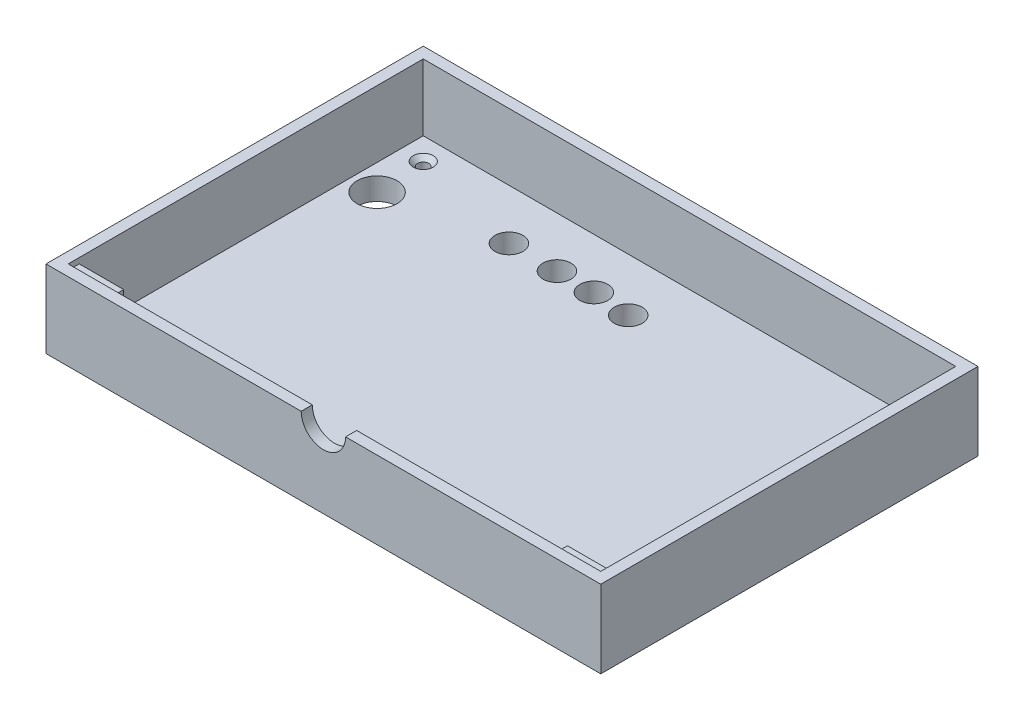
ISO-10303-21;
HEADER;
FILE_DESCRIPTION(('STEP AP214'),'2;1');
FILE_NAME('part.step','',(''),(''),'','','');
FILE_SCHEMA(('AUTOMOTIVE_DESIGN { 1 0 10303 214 1 1 1 1 }'));
ENDSEC;
DATA;
#1=APPLICATION_CONTEXT('core data for automotive mechanical design processes');
#2=APPLICATION_PROTOCOL_DEFINITION('international standard','automotive_design',2000,#1);
#3=PRODUCT_CONTEXT('',#1,'mechanical');
#4=PRODUCT('Part','Part','',(#3));
#5=PRODUCT_RELATED_PRODUCT_CATEGORY('part','',(#4));
#6=PRODUCT_DEFINITION_FORMATION('','',#4);
#7=PRODUCT_DEFINITION_CONTEXT('part definition',#1,'design');
#8=PRODUCT_DEFINITION('design','',#6,#7);
#9=PRODUCT_DEFINITION_SHAPE('','',#8);
#10=(LENGTH_UNIT() NAMED_UNIT(*) SI_UNIT(.MILLI.,.METRE.));
#11=(NAMED_UNIT(*) PLANE_ANGLE_UNIT() SI_UNIT($,.RADIAN.));
#12=(NAMED_UNIT(*) SI_UNIT($,.STERADIAN.) SOLID_ANGLE_UNIT());
#13=UNCERTAINTY_MEASURE_WITH_UNIT(LENGTH_MEASURE(1.E-05),#10,'distance_accuracy_value','');
#14=(GEOMETRIC_REPRESENTATION_CONTEXT(3) GLOBAL_UNCERTAINTY_ASSIGNED_CONTEXT((#13)) GLOBAL_UNIT_ASSIGNED_CONTEXT((#10,
#11,#12)) REPRESENTATION_CONTEXT('',''));
#15=CARTESIAN_POINT('',(0.,0.,0.));
#16=DIRECTION('',(0.,0.,1.));
#17=DIRECTION('',(1.,0.,0.));
#18=AXIS2_PLACEMENT_3D('',#15,#16,#17);
#19=CARTESIAN_POINT('',(-152.4,47.625,95.25));
#20=DIRECTION('',(1.,0.,0.));
#21=DIRECTION('',(0.,0.,-1.));
#22=AXIS2_PLACEMENT_3D('',#19,#20,#21);
#23=PLANE('',#22);
#24=DIRECTION('',(0.,1.,0.));
#25=VECTOR('',#24,1.);
#26=CARTESIAN_POINT('',(-152.4,47.625,101.6));
#27=LINE('',#26,#25);
#28=CARTESIAN_POINT('',(-152.4,41.275,101.6));
#29=VERTEX_POINT('',#28);
#30=CARTESIAN_POINT('',(-152.4,47.625,101.6));
#31=VERTEX_POINT('',#30);
#32=EDGE_CURVE('E109',#29,#31,#27,.T.);
#33=ORIENTED_EDGE('',*,*,#32,.T.);
#34=DIRECTION('',(0.,0.,1.));
#35=VECTOR('',#34,1.);
#36=CARTESIAN_POINT('',(-152.4,47.625,95.25));
#37=LINE('',#36,#35);
#38=CARTESIAN_POINT('',(-152.4,47.625,95.25));
#39=VERTEX_POINT('',#38);
#40=EDGE_CURVE('E12',#39,#31,#37,.T.);
#41=ORIENTED_EDGE('',*,*,#40,.F.);
#42=DIRECTION('',(0.,1.,0.));
#43=VECTOR('',#42,1.);
#44=CARTESIAN_POINT('',(-152.4,47.625,95.25));
#45=LINE('',#44,#43);
#46=CARTESIAN_POINT('',(-152.4,41.275,95.25));
#47=VERTEX_POINT('',#46);
#48=EDGE_CURVE('E97',#47,#39,#45,.T.);
#49=ORIENTED_EDGE('',*,*,#48,.F.);
#50=DIRECTION('',(0.,0.,1.));
#51=VECTOR('',#50,1.);
#52=CARTESIAN_POINT('',(-152.4,41.275,95.25));
#53=LINE('',#52,#51);
#54=EDGE_CURVE('E105',#47,#29,#53,.T.);
#55=ORIENTED_EDGE('',*,*,#54,.T.);
#56=EDGE_LOOP('',(#33,#41,#49,#55));
#57=FACE_BOUND('',#56,.T.);
#58=ADVANCED_FACE('F46',(#57),#23,.F.);
#59=CARTESIAN_POINT('',(-152.4,47.625,95.25));
#60=DIRECTION('',(0.,-1.,0.));
#61=DIRECTION('',(0.,0.,-1.));
#62=AXIS2_PLACEMENT_3D('',#59,#60,#61);
#63=PLANE('',#62);
#64=DIRECTION('',(1.,0.,0.));
#65=VECTOR('',#64,1.);
#66=CARTESIAN_POINT('',(-152.4,47.625,101.6));
#67=LINE('',#66,#65);
#68=CARTESIAN_POINT('',(-127.,47.625,101.6));
#69=VERTEX_POINT('',#68);
#70=EDGE_CURVE('E101',#31,#69,#67,.T.);
#71=ORIENTED_EDGE('',*,*,#70,.T.);
#72=DIRECTION('',(0.,0.,1.));
#73=VECTOR('',#72,1.);
#74=CARTESIAN_POINT('',(-127.,47.625,95.25));
#75=LINE('',#74,#73);
#76=CARTESIAN_POINT('',(-127.,47.625,95.25));
#77=VERTEX_POINT('',#76);
#78=EDGE_CURVE('E54',#77,#69,#75,.T.);
#79=ORIENTED_EDGE('',*,*,#78,.F.);
#80=DIRECTION('',(1.,0.,0.));
#81=VECTOR('',#80,1.);
#82=CARTESIAN_POINT('',(-152.4,47.625,95.25));
#83=LINE('',#82,#81);
#84=EDGE_CURVE('E92',#39,#77,#83,.T.);
#85=ORIENTED_EDGE('',*,*,#84,.F.);
#86=ORIENTED_EDGE('',*,*,#40,.T.);
#87=EDGE_LOOP('',(#71,#79,#85,#86));
#88=FACE_BOUND('',#87,.T.);
#89=ADVANCED_FACE('F100',(#88),#63,.F.);
#90=CARTESIAN_POINT('',(-127.,47.625,95.25));
#91=DIRECTION('',(-1.,0.,0.));
#92=DIRECTION('',(0.,0.,1.));
#93=AXIS2_PLACEMENT_3D('',#90,#91,#92);
#94=PLANE('',#93);
#95=DIRECTION('',(0.,-1.,0.));
#96=VECTOR('',#95,1.);
#97=CARTESIAN_POINT('',(-127.,47.625,101.6));
#98=LINE('',#97,#96);
#99=CARTESIAN_POINT('',(-127.,41.275,101.6));
#100=VERTEX_POINT('',#99);
#101=EDGE_CURVE('E79',#69,#100,#98,.T.);
#102=ORIENTED_EDGE('',*,*,#101,.T.);
#103=DIRECTION('',(0.,0.,1.));
#104=VECTOR('',#103,1.);
#105=CARTESIAN_POINT('',(-127.,41.275,95.25));
#106=LINE('',#105,#104);
#107=CARTESIAN_POINT('',(-127.,41.275,95.25));
#108=VERTEX_POINT('',#107);
#109=EDGE_CURVE('E102',#108,#100,#106,.T.);
#110=ORIENTED_EDGE('',*,*,#109,.F.);
#111=DIRECTION('',(0.,-1.,0.));
#112=VECTOR('',#111,1.);
#113=CARTESIAN_POINT('',(-127.,47.625,95.25));
#114=LINE('',#113,#112);
#115=EDGE_CURVE('E95',#77,#108,#114,.T.);
#116=ORIENTED_EDGE('',*,*,#115,.F.);
#117=ORIENTED_EDGE('',*,*,#78,.T.);
#118=EDGE_LOOP('',(#102,#110,#116,#117));
#119=FACE_BOUND('',#118,.T.);
#120=ADVANCED_FACE('F103',(#119),#94,.F.);
#121=CARTESIAN_POINT('',(-152.4,41.275,95.25));
#122=DIRECTION('',(0.,1.,0.));
#123=DIRECTION('',(0.,0.,1.));
#124=AXIS2_PLACEMENT_3D('',#121,#122,#123);
#125=PLANE('',#124);
#126=DIRECTION('',(-1.,0.,0.));
#127=VECTOR('',#126,1.);
#128=CARTESIAN_POINT('',(-152.4,41.275,101.6));
#129=LINE('',#128,#127);
#130=EDGE_CURVE('E85',#100,#29,#129,.T.);
#131=ORIENTED_EDGE('',*,*,#130,.T.);
#132=ORIENTED_EDGE('',*,*,#54,.F.);
#133=DIRECTION('',(-1.,0.,0.));
#134=VECTOR('',#133,1.);
#135=CARTESIAN_POINT('',(-152.4,41.275,95.25));
#136=LINE('',#135,#134);
#137=EDGE_CURVE('E62',#108,#47,#136,.T.);
#138=ORIENTED_EDGE('',*,*,#137,.F.);
#139=ORIENTED_EDGE('',*,*,#109,.T.);
#140=EDGE_LOOP('',(#131,#132,#138,#139));
#141=FACE_BOUND('',#140,.T.);
#142=ADVANCED_FACE('F116',(#141),#125,.F.);
#143=CARTESIAN_POINT('',(0.,0.,95.25));
#144=DIRECTION('',(0.,0.,1.));
#145=DIRECTION('',(1.,0.,0.));
#146=AXIS2_PLACEMENT_3D('',#143,#144,#145);
#147=PLANE('',#146);
#148=ORIENTED_EDGE('',*,*,#48,.T.);
#149=ORIENTED_EDGE('',*,*,#84,.T.);
#150=ORIENTED_EDGE('',*,*,#115,.T.);
#151=ORIENTED_EDGE('',*,*,#137,.T.);
#152=EDGE_LOOP('',(#148,#149,#150,#151));
#153=FACE_BOUND('',#152,.T.);
#154=ADVANCED_FACE('F93',(#153),#147,.F.);
#155=CARTESIAN_POINT('',(0.,0.,101.6));
#156=DIRECTION('',(0.,0.,1.));
#157=DIRECTION('',(1.,0.,0.));
#158=AXIS2_PLACEMENT_3D('',#155,#156,#157);
#159=PLANE('',#158);
#160=ORIENTED_EDGE('',*,*,#32,.F.);
#161=ORIENTED_EDGE('',*,*,#130,.F.);
#162=ORIENTED_EDGE('',*,*,#101,.F.);
#163=ORIENTED_EDGE('',*,*,#70,.F.);
#164=EDGE_LOOP('',(#160,#161,#162,#163));
#165=FACE_BOUND('',#164,.T.);
#166=ADVANCED_FACE('F119',(#165),#159,.T.);
#167=CLOSED_SHELL('',(#58,#89,#120,#142,#154,#166));
#168=MANIFOLD_SOLID_BREP('B2',#167);
#169=CARTESIAN_POINT('',(152.4,47.625,95.25));
#170=DIRECTION('',(-1.,0.,0.));
#171=DIRECTION('',(0.,0.,1.));
#172=AXIS2_PLACEMENT_3D('',#169,#170,#171);
#173=PLANE('',#172);
#174=DIRECTION('',(0.,-1.,0.));
#175=VECTOR('',#174,1.);
#176=CARTESIAN_POINT('',(152.4,47.625,101.6));
#177=LINE('',#176,#175);
#178=CARTESIAN_POINT('',(152.4,47.625,101.6));
#179=VERTEX_POINT('',#178);
#180=CARTESIAN_POINT('',(152.4,41.275,101.6));
#181=VERTEX_POINT('',#180);
#182=EDGE_CURVE('E242',#179,#181,#177,.T.);
#183=ORIENTED_EDGE('',*,*,#182,.T.);
#184=DIRECTION('',(0.,0.,1.));
#185=VECTOR('',#184,1.);
#186=CARTESIAN_POINT('',(152.4,41.275,95.25));
#187=LINE('',#186,#185);
#188=CARTESIAN_POINT('',(152.4,41.275,95.25));
#189=VERTEX_POINT('',#188);
#190=EDGE_CURVE('E44',#189,#181,#187,.T.);
#191=ORIENTED_EDGE('',*,*,#190,.F.);
#192=DIRECTION('',(0.,-1.,0.));
#193=VECTOR('',#192,1.);
#194=CARTESIAN_POINT('',(152.4,47.625,95.25));
#195=LINE('',#194,#193);
#196=CARTESIAN_POINT('',(152.4,47.625,95.25));
#197=VERTEX_POINT('',#196);
#198=EDGE_CURVE('E230',#197,#189,#195,.T.);
#199=ORIENTED_EDGE('',*,*,#198,.F.);
#200=DIRECTION('',(0.,0.,1.));
#201=VECTOR('',#200,1.);
#202=CARTESIAN_POINT('',(152.4,47.625,95.25));
#203=LINE('',#202,#201);
#204=EDGE_CURVE('E238',#197,#179,#203,.T.);
#205=ORIENTED_EDGE('',*,*,#204,.T.);
#206=EDGE_LOOP('',(#183,#191,#199,#205));
#207=FACE_BOUND('',#206,.T.);
#208=ADVANCED_FACE('F179',(#207),#173,.F.);
#209=CARTESIAN_POINT('',(152.4,41.275,95.25));
#210=DIRECTION('',(0.,1.,0.));
#211=DIRECTION('',(0.,0.,1.));
#212=AXIS2_PLACEMENT_3D('',#209,#210,#211);
#213=PLANE('',#212);
#214=DIRECTION('',(-1.,0.,0.));
#215=VECTOR('',#214,1.);
#216=CARTESIAN_POINT('',(152.4,41.275,101.6));
#217=LINE('',#216,#215);
#218=CARTESIAN_POINT('',(127.,41.275,101.6));
#219=VERTEX_POINT('',#218);
#220=EDGE_CURVE('E234',#181,#219,#217,.T.);
#221=ORIENTED_EDGE('',*,*,#220,.T.);
#222=DIRECTION('',(0.,0.,1.));
#223=VECTOR('',#222,1.);
#224=CARTESIAN_POINT('',(127.,41.275,95.25));
#225=LINE('',#224,#223);
#226=CARTESIAN_POINT('',(127.,41.275,95.25));
#227=VERTEX_POINT('',#226);
#228=EDGE_CURVE('E187',#227,#219,#225,.T.);
#229=ORIENTED_EDGE('',*,*,#228,.F.);
#230=DIRECTION('',(-1.,0.,0.));
#231=VECTOR('',#230,1.);
#232=CARTESIAN_POINT('',(152.4,41.275,95.25));
#233=LINE('',#232,#231);
#234=EDGE_CURVE('E225',#189,#227,#233,.T.);
#235=ORIENTED_EDGE('',*,*,#234,.F.);
#236=ORIENTED_EDGE('',*,*,#190,.T.);
#237=EDGE_LOOP('',(#221,#229,#235,#236));
#238=FACE_BOUND('',#237,.T.);
#239=ADVANCED_FACE('F233',(#238),#213,.F.);
#240=CARTESIAN_POINT('',(127.,47.625,95.25));
#241=DIRECTION('',(1.,0.,0.));
#242=DIRECTION('',(0.,0.,-1.));
#243=AXIS2_PLACEMENT_3D('',#240,#241,#242);
#244=PLANE('',#243);
#245=DIRECTION('',(0.,1.,0.));
#246=VECTOR('',#245,1.);
#247=CARTESIAN_POINT('',(127.,47.625,101.6));
#248=LINE('',#247,#246);
#249=CARTESIAN_POINT('',(127.,47.625,101.6));
#250=VERTEX_POINT('',#249);
#251=EDGE_CURVE('E212',#219,#250,#248,.T.);
#252=ORIENTED_EDGE('',*,*,#251,.T.);
#253=DIRECTION('',(0.,0.,1.));
#254=VECTOR('',#253,1.);
#255=CARTESIAN_POINT('',(127.,47.625,95.25));
#256=LINE('',#255,#254);
#257=CARTESIAN_POINT('',(127.,47.625,95.25));
#258=VERTEX_POINT('',#257);
#259=EDGE_CURVE('E235',#258,#250,#256,.T.);
#260=ORIENTED_EDGE('',*,*,#259,.F.);
#261=DIRECTION('',(0.,1.,0.));
#262=VECTOR('',#261,1.);
#263=CARTESIAN_POINT('',(127.,47.625,95.25));
#264=LINE('',#263,#262);
#265=EDGE_CURVE('E228',#227,#258,#264,.T.);
#266=ORIENTED_EDGE('',*,*,#265,.F.);
#267=ORIENTED_EDGE('',*,*,#228,.T.);
#268=EDGE_LOOP('',(#252,#260,#266,#267));
#269=FACE_BOUND('',#268,.T.);
#270=ADVANCED_FACE('F236',(#269),#244,.F.);
#271=CARTESIAN_POINT('',(152.4,47.625,95.25));
#272=DIRECTION('',(0.,-1.,0.));
#273=DIRECTION('',(0.,0.,-1.));
#274=AXIS2_PLACEMENT_3D('',#271,#272,#273);
#275=PLANE('',#274);
#276=DIRECTION('',(1.,0.,0.));
#277=VECTOR('',#276,1.);
#278=CARTESIAN_POINT('',(152.4,47.625,101.6));
#279=LINE('',#278,#277);
#280=EDGE_CURVE('E218',#250,#179,#279,.T.);
#281=ORIENTED_EDGE('',*,*,#280,.T.);
#282=ORIENTED_EDGE('',*,*,#204,.F.);
#283=DIRECTION('',(1.,0.,0.));
#284=VECTOR('',#283,1.);
#285=CARTESIAN_POINT('',(152.4,47.625,95.25));
#286=LINE('',#285,#284);
#287=EDGE_CURVE('E195',#258,#197,#286,.T.);
#288=ORIENTED_EDGE('',*,*,#287,.F.);
#289=ORIENTED_EDGE('',*,*,#259,.T.);
#290=EDGE_LOOP('',(#281,#282,#288,#289));
#291=FACE_BOUND('',#290,.T.);
#292=ADVANCED_FACE('F249',(#291),#275,.F.);
#293=CARTESIAN_POINT('',(0.,0.,95.25));
#294=DIRECTION('',(0.,0.,-1.));
#295=DIRECTION('',(-1.,0.,0.));
#296=AXIS2_PLACEMENT_3D('',#293,#294,#295);
#297=PLANE('',#296);
#298=ORIENTED_EDGE('',*,*,#198,.T.);
#299=ORIENTED_EDGE('',*,*,#234,.T.);
#300=ORIENTED_EDGE('',*,*,#265,.T.);
#301=ORIENTED_EDGE('',*,*,#287,.T.);
#302=EDGE_LOOP('',(#298,#299,#300,#301));
#303=FACE_BOUND('',#302,.T.);
#304=ADVANCED_FACE('F226',(#303),#297,.T.);
#305=CARTESIAN_POINT('',(0.,0.,101.6));
#306=DIRECTION('',(0.,0.,-1.));
#307=DIRECTION('',(-1.,0.,0.));
#308=AXIS2_PLACEMENT_3D('',#305,#306,#307);
#309=PLANE('',#308);
#310=ORIENTED_EDGE('',*,*,#182,.F.);
#311=ORIENTED_EDGE('',*,*,#280,.F.);
#312=ORIENTED_EDGE('',*,*,#251,.F.);
#313=ORIENTED_EDGE('',*,*,#220,.F.);
#314=EDGE_LOOP('',(#310,#311,#312,#313));
#315=FACE_BOUND('',#314,.T.);
#316=ADVANCED_FACE('F252',(#315),#309,.F.);
#317=CLOSED_SHELL('',(#208,#239,#270,#292,#304,#316));
#318=MANIFOLD_SOLID_BREP('B6',#317);
#319=CARTESIAN_POINT('',(158.75,12.7,107.95));
#320=DIRECTION('',(0.,0.,-1.));
#321=DIRECTION('',(-1.,0.,0.));
#322=AXIS2_PLACEMENT_3D('',#319,#320,#321);
#323=PLANE('',#322);
#324=CARTESIAN_POINT('',(0.,50.8,107.95));
#325=DIRECTION('',(0.,0.,-1.));
#326=DIRECTION('',(-1.,0.,0.));
#327=AXIS2_PLACEMENT_3D('',#324,#325,#326);
#328=CIRCLE('',#327,12.7);
#329=CARTESIAN_POINT('',(12.7,50.8,107.95));
#330=VERTEX_POINT('',#329);
#331=CARTESIAN_POINT('',(-12.7,50.8,107.95));
#332=VERTEX_POINT('',#331);
#333=EDGE_CURVE('E409',#330,#332,#328,.T.);
#334=ORIENTED_EDGE('',*,*,#333,.T.);
#335=DIRECTION('',(1.,0.,0.));
#336=VECTOR('',#335,1.);
#337=CARTESIAN_POINT('',(-158.75,50.8,107.95));
#338=LINE('',#337,#336);
#339=CARTESIAN_POINT('',(-158.75,50.8,107.95));
#340=VERTEX_POINT('',#339);
#341=EDGE_CURVE('E419',#340,#332,#338,.T.);
#342=ORIENTED_EDGE('',*,*,#341,.F.);
#343=DIRECTION('',(0.,-1.,0.));
#344=VECTOR('',#343,1.);
#345=CARTESIAN_POINT('',(-158.75,12.7,107.95));
#346=LINE('',#345,#344);
#347=CARTESIAN_POINT('',(-158.75,6.35,107.95));
#348=VERTEX_POINT('',#347);
#349=EDGE_CURVE('E490',#340,#348,#346,.T.);
#350=ORIENTED_EDGE('',*,*,#349,.T.);
#351=DIRECTION('',(1.,0.,0.));
#352=VECTOR('',#351,1.);
#353=CARTESIAN_POINT('',(158.75,6.35,107.95));
#354=LINE('',#353,#352);
#355=CARTESIAN_POINT('',(158.75,6.35,107.95));
#356=VERTEX_POINT('',#355);
#357=EDGE_CURVE('E475',#348,#356,#354,.T.);
#358=ORIENTED_EDGE('',*,*,#357,.T.);
#359=DIRECTION('',(0.,-1.,0.));
#360=VECTOR('',#359,1.);
#361=CARTESIAN_POINT('',(158.75,12.7,107.95));
#362=LINE('',#361,#360);
#363=CARTESIAN_POINT('',(158.75,50.8,107.95));
#364=VERTEX_POINT('',#363);
#365=EDGE_CURVE('E487',#364,#356,#362,.T.);
#366=ORIENTED_EDGE('',*,*,#365,.F.);
#367=EDGE_CURVE('E452',#330,#364,#338,.T.);
#368=ORIENTED_EDGE('',*,*,#367,.F.);
#369=EDGE_LOOP('',(#334,#342,#350,#358,#366,#368));
#370=FACE_BOUND('',#369,.T.);
#371=ADVANCED_FACE('F303',(#370),#323,.F.);
#372=CARTESIAN_POINT('',(0.,50.8,0.));
#373=DIRECTION('',(0.,1.,0.));
#374=DIRECTION('',(0.,0.,1.));
#375=AXIS2_PLACEMENT_3D('',#372,#373,#374);
#376=PLANE('',#375);
#377=ORIENTED_EDGE('',*,*,#341,.T.);
#378=DIRECTION('',(0.,0.,1.));
#379=VECTOR('',#378,1.);
#380=CARTESIAN_POINT('',(-12.7,50.8,101.6));
#381=LINE('',#380,#379);
#382=CARTESIAN_POINT('',(-12.7,50.8,101.6));
#383=VERTEX_POINT('',#382);
#384=EDGE_CURVE('E404',#383,#332,#381,.T.);
#385=ORIENTED_EDGE('',*,*,#384,.F.);
#386=DIRECTION('',(1.,0.,0.));
#387=VECTOR('',#386,1.);
#388=CARTESIAN_POINT('',(152.4,50.8,101.6));
#389=LINE('',#388,#387);
#390=CARTESIAN_POINT('',(-152.4,50.8,101.6));
#391=VERTEX_POINT('',#390);
#392=EDGE_CURVE('E416',#391,#383,#389,.T.);
#393=ORIENTED_EDGE('',*,*,#392,.F.);
#394=DIRECTION('',(0.,0.,1.));
#395=VECTOR('',#394,1.);
#396=CARTESIAN_POINT('',(-152.4,50.8,101.6));
#397=LINE('',#396,#395);
#398=CARTESIAN_POINT('',(-152.4,50.8,-101.6));
#399=VERTEX_POINT('',#398);
#400=EDGE_CURVE('E431',#399,#391,#397,.T.);
#401=ORIENTED_EDGE('',*,*,#400,.F.);
#402=DIRECTION('',(-1.,0.,0.));
#403=VECTOR('',#402,1.);
#404=CARTESIAN_POINT('',(152.4,50.8,-101.6));
#405=LINE('',#404,#403);
#406=CARTESIAN_POINT('',(152.4,50.8,-101.6));
#407=VERTEX_POINT('',#406);
#408=EDGE_CURVE('E660',#407,#399,#405,.T.);
#409=ORIENTED_EDGE('',*,*,#408,.F.);
#410=DIRECTION('',(0.,0.,-1.));
#411=VECTOR('',#410,1.);
#412=CARTESIAN_POINT('',(152.4,50.8,101.6));
#413=LINE('',#412,#411);
#414=CARTESIAN_POINT('',(152.4,50.8,101.6));
#415=VERTEX_POINT('',#414);
#416=EDGE_CURVE('E441',#415,#407,#413,.T.);
#417=ORIENTED_EDGE('',*,*,#416,.F.);
#418=CARTESIAN_POINT('',(12.7,50.8,101.6));
#419=VERTEX_POINT('',#418);
#420=EDGE_CURVE('E427',#419,#415,#389,.T.);
#421=ORIENTED_EDGE('',*,*,#420,.F.);
#422=DIRECTION('',(0.,0.,1.));
#423=VECTOR('',#422,1.);
#424=CARTESIAN_POINT('',(12.7,50.8,101.6));
#425=LINE('',#424,#423);
#426=EDGE_CURVE('E318',#419,#330,#425,.T.);
#427=ORIENTED_EDGE('',*,*,#426,.T.);
#428=ORIENTED_EDGE('',*,*,#367,.T.);
#429=DIRECTION('',(0.,0.,-1.));
#430=VECTOR('',#429,1.);
#431=CARTESIAN_POINT('',(158.75,50.8,-107.95));
#432=LINE('',#431,#430);
#433=CARTESIAN_POINT('',(158.75,50.8,-107.95));
#434=VERTEX_POINT('',#433);
#435=EDGE_CURVE('E454',#364,#434,#432,.T.);
#436=ORIENTED_EDGE('',*,*,#435,.T.);
#437=DIRECTION('',(-1.,0.,0.));
#438=VECTOR('',#437,1.);
#439=CARTESIAN_POINT('',(-158.75,50.8,-107.95));
#440=LINE('',#439,#438);
#441=CARTESIAN_POINT('',(-158.75,50.8,-107.95));
#442=VERTEX_POINT('',#441);
#443=EDGE_CURVE('E457',#434,#442,#440,.T.);
#444=ORIENTED_EDGE('',*,*,#443,.T.);
#445=DIRECTION('',(0.,0.,1.));
#446=VECTOR('',#445,1.);
#447=CARTESIAN_POINT('',(-158.75,50.8,-107.95));
#448=LINE('',#447,#446);
#449=EDGE_CURVE('E450',#442,#340,#448,.T.);
#450=ORIENTED_EDGE('',*,*,#449,.T.);
#451=EDGE_LOOP('',(#377,#385,#393,#401,#409,#417,#421,#427,#428,#436,#444,#450));
#452=FACE_BOUND('',#451,.T.);
#453=ADVANCED_FACE('F414',(#452),#376,.T.);
#454=CARTESIAN_POINT('',(152.4,50.8,101.6));
#455=DIRECTION('',(0.,0.,-1.));
#456=DIRECTION('',(-1.,0.,0.));
#457=AXIS2_PLACEMENT_3D('',#454,#455,#456);
#458=PLANE('',#457);
#459=ORIENTED_EDGE('',*,*,#392,.T.);
#460=CARTESIAN_POINT('',(0.,50.8,101.6));
#461=DIRECTION('',(0.,0.,-1.));
#462=DIRECTION('',(-1.,0.,0.));
#463=AXIS2_PLACEMENT_3D('',#460,#461,#462);
#464=CIRCLE('',#463,12.7);
#465=EDGE_CURVE('E401',#419,#383,#464,.T.);
#466=ORIENTED_EDGE('',*,*,#465,.F.);
#467=ORIENTED_EDGE('',*,*,#420,.T.);
#468=DIRECTION('',(0.,-1.,0.));
#469=VECTOR('',#468,1.);
#470=CARTESIAN_POINT('',(152.4,50.8,101.6));
#471=LINE('',#470,#469);
#472=CARTESIAN_POINT('',(152.4,12.7,101.6));
#473=VERTEX_POINT('',#472);
#474=EDGE_CURVE('E426',#415,#473,#471,.T.);
#475=ORIENTED_EDGE('',*,*,#474,.T.);
#476=DIRECTION('',(1.,0.,0.));
#477=VECTOR('',#476,1.);
#478=CARTESIAN_POINT('',(152.4,12.7,101.6));
#479=LINE('',#478,#477);
#480=CARTESIAN_POINT('',(-152.4,12.7,101.6));
#481=VERTEX_POINT('',#480);
#482=EDGE_CURVE('E440',#481,#473,#479,.T.);
#483=ORIENTED_EDGE('',*,*,#482,.F.);
#484=DIRECTION('',(0.,-1.,0.));
#485=VECTOR('',#484,1.);
#486=CARTESIAN_POINT('',(-152.4,50.8,101.6));
#487=LINE('',#486,#485);
#488=EDGE_CURVE('E424',#391,#481,#487,.T.);
#489=ORIENTED_EDGE('',*,*,#488,.F.);
#490=EDGE_LOOP('',(#459,#466,#467,#475,#483,#489));
#491=FACE_BOUND('',#490,.T.);
#492=ADVANCED_FACE('F421',(#491),#458,.T.);
#493=CARTESIAN_POINT('',(152.4,6.35,101.6));
#494=DIRECTION('',(-1.,0.,0.));
#495=DIRECTION('',(0.,0.,1.));
#496=AXIS2_PLACEMENT_3D('',#493,#494,#495);
#497=PLANE('',#496);
#498=DIRECTION('',(0.,0.,-1.));
#499=VECTOR('',#498,1.);
#500=CARTESIAN_POINT('',(152.4,0.,101.6));
#501=LINE('',#500,#499);
#502=CARTESIAN_POINT('',(152.4,0.,101.6));
#503=VERTEX_POINT('',#502);
#504=CARTESIAN_POINT('',(152.4,0.,-101.6));
#505=VERTEX_POINT('',#504);
#506=EDGE_CURVE('E493',#503,#505,#501,.T.);
#507=ORIENTED_EDGE('',*,*,#506,.T.);
#508=DIRECTION('',(0.,-1.,0.));
#509=VECTOR('',#508,1.);
#510=CARTESIAN_POINT('',(152.4,6.35,-101.6));
#511=LINE('',#510,#509);
#512=CARTESIAN_POINT('',(152.4,6.35,-101.6));
#513=VERTEX_POINT('',#512);
#514=EDGE_CURVE('E521',#513,#505,#511,.T.);
#515=ORIENTED_EDGE('',*,*,#514,.F.);
#516=DIRECTION('',(0.,0.,-1.));
#517=VECTOR('',#516,1.);
#518=CARTESIAN_POINT('',(152.4,6.35,101.6));
#519=LINE('',#518,#517);
#520=CARTESIAN_POINT('',(152.4,6.35,101.6));
#521=VERTEX_POINT('',#520);
#522=EDGE_CURVE('E494',#521,#513,#519,.T.);
#523=ORIENTED_EDGE('',*,*,#522,.F.);
#524=DIRECTION('',(0.,-1.,0.));
#525=VECTOR('',#524,1.);
#526=CARTESIAN_POINT('',(152.4,6.35,101.6));
#527=LINE('',#526,#525);
#528=EDGE_CURVE('E505',#521,#503,#527,.T.);
#529=ORIENTED_EDGE('',*,*,#528,.T.);
#530=EDGE_LOOP('',(#507,#515,#523,#529));
#531=FACE_BOUND('',#530,.T.);
#532=ADVANCED_FACE('F592',(#531),#497,.F.);
#533=CARTESIAN_POINT('',(152.4,6.35,-101.6));
#534=DIRECTION('',(0.,0.,1.));
#535=DIRECTION('',(1.,0.,0.));
#536=AXIS2_PLACEMENT_3D('',#533,#534,#535);
#537=PLANE('',#536);
#538=DIRECTION('',(-1.,0.,0.));
#539=VECTOR('',#538,1.);
#540=CARTESIAN_POINT('',(152.4,0.,-101.6));
#541=LINE('',#540,#539);
#542=CARTESIAN_POINT('',(-152.4,0.,-101.6));
#543=VERTEX_POINT('',#542);
#544=EDGE_CURVE('E508',#505,#543,#541,.T.);
#545=ORIENTED_EDGE('',*,*,#544,.T.);
#546=DIRECTION('',(0.,-1.,0.));
#547=VECTOR('',#546,1.);
#548=CARTESIAN_POINT('',(-152.4,6.35,-101.6));
#549=LINE('',#548,#547);
#550=CARTESIAN_POINT('',(-152.4,6.35,-101.6));
#551=VERTEX_POINT('',#550);
#552=EDGE_CURVE('E519',#551,#543,#549,.T.);
#553=ORIENTED_EDGE('',*,*,#552,.F.);
#554=DIRECTION('',(-1.,0.,0.));
#555=VECTOR('',#554,1.);
#556=CARTESIAN_POINT('',(152.4,6.35,-101.6));
#557=LINE('',#556,#555);
#558=EDGE_CURVE('E496',#513,#551,#557,.T.);
#559=ORIENTED_EDGE('',*,*,#558,.F.);
#560=ORIENTED_EDGE('',*,*,#514,.T.);
#561=EDGE_LOOP('',(#545,#553,#559,#560));
#562=FACE_BOUND('',#561,.T.);
#563=ADVANCED_FACE('F588',(#562),#537,.F.);
#564=CARTESIAN_POINT('',(-152.4,6.35,101.6));
#565=DIRECTION('',(-1.,0.,0.));
#566=DIRECTION('',(0.,0.,1.));
#567=AXIS2_PLACEMENT_3D('',#564,#565,#566);
#568=PLANE('',#567);
#569=DIRECTION('',(0.,0.,-1.));
#570=VECTOR('',#569,1.);
#571=CARTESIAN_POINT('',(-152.4,0.,101.6));
#572=LINE('',#571,#570);
#573=CARTESIAN_POINT('',(-152.4,0.,101.6));
#574=VERTEX_POINT('',#573);
#575=EDGE_CURVE('E511',#574,#543,#572,.T.);
#576=ORIENTED_EDGE('',*,*,#575,.F.);
#577=DIRECTION('',(0.,-1.,0.));
#578=VECTOR('',#577,1.);
#579=CARTESIAN_POINT('',(-152.4,6.35,101.6));
#580=LINE('',#579,#578);
#581=CARTESIAN_POINT('',(-152.4,6.35,101.6));
#582=VERTEX_POINT('',#581);
#583=EDGE_CURVE('E517',#582,#574,#580,.T.);
#584=ORIENTED_EDGE('',*,*,#583,.F.);
#585=DIRECTION('',(0.,0.,-1.));
#586=VECTOR('',#585,1.);
#587=CARTESIAN_POINT('',(-152.4,6.35,101.6));
#588=LINE('',#587,#586);
#589=EDGE_CURVE('E499',#582,#551,#588,.T.);
#590=ORIENTED_EDGE('',*,*,#589,.T.);
#591=ORIENTED_EDGE('',*,*,#552,.T.);
#592=EDGE_LOOP('',(#576,#584,#590,#591));
#593=FACE_BOUND('',#592,.T.);
#594=ADVANCED_FACE('F584',(#593),#568,.T.);
#595=CARTESIAN_POINT('',(152.4,6.35,101.6));
#596=DIRECTION('',(0.,0.,1.));
#597=DIRECTION('',(1.,0.,0.));
#598=AXIS2_PLACEMENT_3D('',#595,#596,#597);
#599=PLANE('',#598);
#600=DIRECTION('',(-1.,0.,0.));
#601=VECTOR('',#600,1.);
#602=CARTESIAN_POINT('',(152.4,0.,101.6));
#603=LINE('',#602,#601);
#604=EDGE_CURVE('E497',#503,#574,#603,.T.);
#605=ORIENTED_EDGE('',*,*,#604,.F.);
#606=ORIENTED_EDGE('',*,*,#528,.F.);
#607=DIRECTION('',(-1.,0.,0.));
#608=VECTOR('',#607,1.);
#609=CARTESIAN_POINT('',(152.4,6.35,101.6));
#610=LINE('',#609,#608);
#611=EDGE_CURVE('E502',#521,#582,#610,.T.);
#612=ORIENTED_EDGE('',*,*,#611,.T.);
#613=ORIENTED_EDGE('',*,*,#583,.T.);
#614=EDGE_LOOP('',(#605,#606,#612,#613));
#615=FACE_BOUND('',#614,.T.);
#616=ADVANCED_FACE('F580',(#615),#599,.T.);
#617=CARTESIAN_POINT('',(0.,0.,0.));
#618=DIRECTION('',(0.,1.,0.));
#619=DIRECTION('',(0.,0.,1.));
#620=AXIS2_PLACEMENT_3D('',#617,#618,#619);
#621=PLANE('',#620);
#622=CARTESIAN_POINT('',(-137.661731299545,0.,-60.4529794712118));
#623=DIRECTION('',(0.,1.,0.));
#624=DIRECTION('',(0.,0.,1.));
#625=AXIS2_PLACEMENT_3D('',#622,#623,#624);
#626=CIRCLE('',#625,11.43);
#627=CARTESIAN_POINT('',(-137.661731299545,0.,-49.0229794712118));
#628=VERTEX_POINT('',#627);
#629=EDGE_CURVE('E726',#628,#628,#626,.T.);
#630=ORIENTED_EDGE('',*,*,#629,.T.);
#631=EDGE_LOOP('',(#630));
#632=FACE_BOUND('',#631,.T.);
#633=CARTESIAN_POINT('',(-47.0679530570788,0.,-72.7923799878463));
#634=DIRECTION('',(0.,1.,0.));
#635=DIRECTION('',(0.,0.,1.));
#636=AXIS2_PLACEMENT_3D('',#633,#634,#635);
#637=CIRCLE('',#636,8.00000000000001);
#638=CARTESIAN_POINT('',(-47.0679530570788,0.,-64.7923799878463));
#639=VERTEX_POINT('',#638);
#640=EDGE_CURVE('E730',#639,#639,#637,.T.);
#641=ORIENTED_EDGE('',*,*,#640,.T.);
#642=EDGE_LOOP('',(#641));
#643=FACE_BOUND('',#642,.T.);
#644=CARTESIAN_POINT('',(-74.5509512053568,0.,-72.7923799878463));
#645=DIRECTION('',(0.,1.,0.));
#646=DIRECTION('',(0.,0.,1.));
#647=AXIS2_PLACEMENT_3D('',#644,#645,#646);
#648=CIRCLE('',#647,8.00000000000001);
#649=CARTESIAN_POINT('',(-74.5509512053568,0.,-64.7923799878463));
#650=VERTEX_POINT('',#649);
#651=EDGE_CURVE('E739',#650,#650,#648,.T.);
#652=ORIENTED_EDGE('',*,*,#651,.T.);
#653=EDGE_LOOP('',(#652));
#654=FACE_BOUND('',#653,.T.);
#655=CARTESIAN_POINT('',(-25.9499358025322,0.,-72.7923799878463));
#656=DIRECTION('',(0.,1.,0.));
#657=DIRECTION('',(0.,0.,1.));
#658=AXIS2_PLACEMENT_3D('',#655,#656,#657);
#659=CIRCLE('',#658,8.00000000000001);
#660=CARTESIAN_POINT('',(-25.9499358025322,0.,-64.7923799878463));
#661=VERTEX_POINT('',#660);
#662=EDGE_CURVE('E745',#661,#661,#659,.T.);
#663=ORIENTED_EDGE('',*,*,#662,.T.);
#664=EDGE_LOOP('',(#663));
#665=FACE_BOUND('',#664,.T.);
#666=CARTESIAN_POINT('',(-4.79664067403796,0.,-71.3076454508359));
#667=DIRECTION('',(0.,1.,0.));
#668=DIRECTION('',(0.,0.,1.));
#669=AXIS2_PLACEMENT_3D('',#666,#667,#668);
#670=CIRCLE('',#669,8.00000000000002);
#671=CARTESIAN_POINT('',(-4.79664067403796,0.,-63.3076454508359));
#672=VERTEX_POINT('',#671);
#673=EDGE_CURVE('E751',#672,#672,#670,.T.);
#674=ORIENTED_EDGE('',*,*,#673,.T.);
#675=EDGE_LOOP('',(#674));
#676=FACE_BOUND('',#675,.T.);
#677=CARTESIAN_POINT('',(-139.7,0.,-88.9));
#678=DIRECTION('',(0.,1.,0.));
#679=DIRECTION('',(0.,0.,1.));
#680=AXIS2_PLACEMENT_3D('',#677,#678,#679);
#681=CIRCLE('',#680,3.175);
#682=CARTESIAN_POINT('',(-139.7,0.,-85.725));
#683=VERTEX_POINT('',#682);
#684=EDGE_CURVE('E460',#683,#683,#681,.T.);
#685=ORIENTED_EDGE('',*,*,#684,.T.);
#686=EDGE_LOOP('',(#685));
#687=FACE_BOUND('',#686,.T.);
#688=CARTESIAN_POINT('',(-139.7,0.,88.9));
#689=DIRECTION('',(0.,1.,0.));
#690=DIRECTION('',(0.,0.,-1.));
#691=AXIS2_PLACEMENT_3D('',#688,#689,#690);
#692=CIRCLE('',#691,3.17499999999997);
#693=CARTESIAN_POINT('',(-139.7,0.,85.7250000000001));
#694=VERTEX_POINT('',#693);
#695=EDGE_CURVE('E465',#694,#694,#692,.T.);
#696=ORIENTED_EDGE('',*,*,#695,.T.);
#697=EDGE_LOOP('',(#696));
#698=FACE_BOUND('',#697,.T.);
#699=CARTESIAN_POINT('',(139.7,0.,88.9));
#700=DIRECTION('',(0.,1.,0.));
#701=DIRECTION('',(0.,0.,1.));
#702=AXIS2_PLACEMENT_3D('',#699,#700,#701);
#703=CIRCLE('',#702,3.17499999999997);
#704=CARTESIAN_POINT('',(139.7,0.,92.075));
#705=VERTEX_POINT('',#704);
#706=EDGE_CURVE('E461',#705,#705,#703,.T.);
#707=ORIENTED_EDGE('',*,*,#706,.T.);
#708=EDGE_LOOP('',(#707));
#709=FACE_BOUND('',#708,.T.);
#710=CARTESIAN_POINT('',(139.7,0.,-88.9));
#711=DIRECTION('',(0.,1.,0.));
#712=DIRECTION('',(0.,0.,-1.));
#713=AXIS2_PLACEMENT_3D('',#710,#711,#712);
#714=CIRCLE('',#713,3.175);
#715=CARTESIAN_POINT('',(139.7,0.,-92.075));
#716=VERTEX_POINT('',#715);
#717=EDGE_CURVE('E464',#716,#716,#714,.T.);
#718=ORIENTED_EDGE('',*,*,#717,.T.);
#719=EDGE_LOOP('',(#718));
#720=FACE_BOUND('',#719,.T.);
#721=ORIENTED_EDGE('',*,*,#506,.F.);
#722=ORIENTED_EDGE('',*,*,#604,.T.);
#723=ORIENTED_EDGE('',*,*,#575,.T.);
#724=ORIENTED_EDGE('',*,*,#544,.F.);
#725=EDGE_LOOP('',(#721,#722,#723,#724));
#726=FACE_BOUND('',#725,.T.);
#727=ADVANCED_FACE('F577',(#632,#643,#654,#665,#676,#687,#698,#709,#720,#726),#621,.F.);
#728=CARTESIAN_POINT('',(0.,6.35,0.));
#729=DIRECTION('',(0.,1.,0.));
#730=DIRECTION('',(0.,0.,1.));
#731=AXIS2_PLACEMENT_3D('',#728,#729,#730);
#732=PLANE('',#731);
#733=DIRECTION('',(0.,0.,1.));
#734=VECTOR('',#733,1.);
#735=CARTESIAN_POINT('',(-158.75,6.35,107.95));
#736=LINE('',#735,#734);
#737=CARTESIAN_POINT('',(-158.75,6.35,-107.95));
#738=VERTEX_POINT('',#737);
#739=EDGE_CURVE('E472',#738,#348,#736,.T.);
#740=ORIENTED_EDGE('',*,*,#739,.F.);
#741=DIRECTION('',(-1.,0.,0.));
#742=VECTOR('',#741,1.);
#743=CARTESIAN_POINT('',(158.75,6.35,-107.95));
#744=LINE('',#743,#742);
#745=CARTESIAN_POINT('',(158.75,6.35,-107.95));
#746=VERTEX_POINT('',#745);
#747=EDGE_CURVE('E479',#746,#738,#744,.T.);
#748=ORIENTED_EDGE('',*,*,#747,.F.);
#749=DIRECTION('',(0.,0.,-1.));
#750=VECTOR('',#749,1.);
#751=CARTESIAN_POINT('',(158.75,6.35,107.95));
#752=LINE('',#751,#750);
#753=EDGE_CURVE('E477',#356,#746,#752,.T.);
#754=ORIENTED_EDGE('',*,*,#753,.F.);
#755=ORIENTED_EDGE('',*,*,#357,.F.);
#756=EDGE_LOOP('',(#740,#748,#754,#755));
#757=FACE_BOUND('',#756,.T.);
#758=ORIENTED_EDGE('',*,*,#611,.F.);
#759=ORIENTED_EDGE('',*,*,#522,.T.);
#760=ORIENTED_EDGE('',*,*,#558,.T.);
#761=ORIENTED_EDGE('',*,*,#589,.F.);
#762=EDGE_LOOP('',(#758,#759,#760,#761));
#763=FACE_BOUND('',#762,.T.);
#764=ADVANCED_FACE('F575',(#757,#763),#732,.F.);
#765=CARTESIAN_POINT('',(-158.75,12.7,107.95));
#766=DIRECTION('',(1.,0.,0.));
#767=DIRECTION('',(0.,0.,-1.));
#768=AXIS2_PLACEMENT_3D('',#765,#766,#767);
#769=PLANE('',#768);
#770=ORIENTED_EDGE('',*,*,#739,.T.);
#771=ORIENTED_EDGE('',*,*,#349,.F.);
#772=ORIENTED_EDGE('',*,*,#449,.F.);
#773=DIRECTION('',(0.,-1.,0.));
#774=VECTOR('',#773,1.);
#775=CARTESIAN_POINT('',(-158.75,12.7,-107.95));
#776=LINE('',#775,#774);
#777=EDGE_CURVE('E481',#442,#738,#776,.T.);
#778=ORIENTED_EDGE('',*,*,#777,.T.);
#779=EDGE_LOOP('',(#770,#771,#772,#778));
#780=FACE_BOUND('',#779,.T.);
#781=ADVANCED_FACE('F572',(#780),#769,.F.);
#782=CARTESIAN_POINT('',(158.75,12.7,107.95));
#783=DIRECTION('',(-1.,0.,0.));
#784=DIRECTION('',(0.,0.,1.));
#785=AXIS2_PLACEMENT_3D('',#782,#783,#784);
#786=PLANE('',#785);
#787=ORIENTED_EDGE('',*,*,#753,.T.);
#788=DIRECTION('',(0.,-1.,0.));
#789=VECTOR('',#788,1.);
#790=CARTESIAN_POINT('',(158.75,12.7,-107.95));
#791=LINE('',#790,#789);
#792=EDGE_CURVE('E484',#434,#746,#791,.T.);
#793=ORIENTED_EDGE('',*,*,#792,.F.);
#794=ORIENTED_EDGE('',*,*,#435,.F.);
#795=ORIENTED_EDGE('',*,*,#365,.T.);
#796=EDGE_LOOP('',(#787,#793,#794,#795));
#797=FACE_BOUND('',#796,.T.);
#798=ADVANCED_FACE('F570',(#797),#786,.F.);
#799=CARTESIAN_POINT('',(158.75,12.7,-107.95));
#800=DIRECTION('',(0.,0.,1.));
#801=DIRECTION('',(1.,0.,0.));
#802=AXIS2_PLACEMENT_3D('',#799,#800,#801);
#803=PLANE('',#802);
#804=ORIENTED_EDGE('',*,*,#747,.T.);
#805=ORIENTED_EDGE('',*,*,#777,.F.);
#806=ORIENTED_EDGE('',*,*,#443,.F.);
#807=ORIENTED_EDGE('',*,*,#792,.T.);
#808=EDGE_LOOP('',(#804,#805,#806,#807));
#809=FACE_BOUND('',#808,.T.);
#810=ADVANCED_FACE('F639',(#809),#803,.F.);
#811=CARTESIAN_POINT('',(0.,12.7,0.));
#812=DIRECTION('',(0.,1.,0.));
#813=DIRECTION('',(0.,0.,1.));
#814=AXIS2_PLACEMENT_3D('',#811,#812,#813);
#815=PLANE('',#814);
#816=CARTESIAN_POINT('',(-137.661731299545,12.7,-60.4529794712118));
#817=DIRECTION('',(0.,1.,0.));
#818=DIRECTION('',(0.,0.,1.));
#819=AXIS2_PLACEMENT_3D('',#816,#817,#818);
#820=CIRCLE('',#819,11.43);
#821=CARTESIAN_POINT('',(-137.661731299545,12.7,-49.0229794712118));
#822=VERTEX_POINT('',#821);
#823=EDGE_CURVE('E729',#822,#822,#820,.T.);
#824=ORIENTED_EDGE('',*,*,#823,.F.);
#825=EDGE_LOOP('',(#824));
#826=FACE_BOUND('',#825,.T.);
#827=CARTESIAN_POINT('',(-47.0679530570788,12.7,-72.7923799878463));
#828=DIRECTION('',(0.,1.,0.));
#829=DIRECTION('',(0.,0.,1.));
#830=AXIS2_PLACEMENT_3D('',#827,#828,#829);
#831=CIRCLE('',#830,8.00000000000001);
#832=CARTESIAN_POINT('',(-47.0679530570788,12.7,-64.7923799878463));
#833=VERTEX_POINT('',#832);
#834=EDGE_CURVE('E734',#833,#833,#831,.T.);
#835=ORIENTED_EDGE('',*,*,#834,.F.);
#836=EDGE_LOOP('',(#835));
#837=FACE_BOUND('',#836,.T.);
#838=CARTESIAN_POINT('',(-74.5509512053568,12.7,-72.7923799878463));
#839=DIRECTION('',(0.,1.,0.));
#840=DIRECTION('',(0.,0.,1.));
#841=AXIS2_PLACEMENT_3D('',#838,#839,#840);
#842=CIRCLE('',#841,8.00000000000001);
#843=CARTESIAN_POINT('',(-74.5509512053568,12.7,-64.7923799878463));
#844=VERTEX_POINT('',#843);
#845=EDGE_CURVE('E742',#844,#844,#842,.T.);
#846=ORIENTED_EDGE('',*,*,#845,.F.);
#847=EDGE_LOOP('',(#846));
#848=FACE_BOUND('',#847,.T.);
#849=CARTESIAN_POINT('',(-25.9499358025322,12.7,-72.7923799878463));
#850=DIRECTION('',(0.,1.,0.));
#851=DIRECTION('',(0.,0.,1.));
#852=AXIS2_PLACEMENT_3D('',#849,#850,#851);
#853=CIRCLE('',#852,8.00000000000001);
#854=CARTESIAN_POINT('',(-25.9499358025322,12.7,-64.7923799878463));
#855=VERTEX_POINT('',#854);
#856=EDGE_CURVE('E748',#855,#855,#853,.T.);
#857=ORIENTED_EDGE('',*,*,#856,.F.);
#858=EDGE_LOOP('',(#857));
#859=FACE_BOUND('',#858,.T.);
#860=CARTESIAN_POINT('',(-4.79664067403796,12.7,-71.3076454508359));
#861=DIRECTION('',(0.,1.,0.));
#862=DIRECTION('',(0.,0.,1.));
#863=AXIS2_PLACEMENT_3D('',#860,#861,#862);
#864=CIRCLE('',#863,8.00000000000002);
#865=CARTESIAN_POINT('',(-4.79664067403796,12.7,-63.3076454508359));
#866=VERTEX_POINT('',#865);
#867=EDGE_CURVE('E754',#866,#866,#864,.T.);
#868=ORIENTED_EDGE('',*,*,#867,.F.);
#869=EDGE_LOOP('',(#868));
#870=FACE_BOUND('',#869,.T.);
#871=DIRECTION('',(0.,0.,-1.));
#872=VECTOR('',#871,1.);
#873=CARTESIAN_POINT('',(152.4,12.7,101.6));
#874=LINE('',#873,#872);
#875=CARTESIAN_POINT('',(152.4,12.7,-101.6));
#876=VERTEX_POINT('',#875);
#877=EDGE_CURVE('E326',#473,#876,#874,.T.);
#878=ORIENTED_EDGE('',*,*,#877,.T.);
#879=DIRECTION('',(-1.,0.,0.));
#880=VECTOR('',#879,1.);
#881=CARTESIAN_POINT('',(152.4,12.7,-101.6));
#882=LINE('',#881,#880);
#883=CARTESIAN_POINT('',(-152.4,12.7,-101.6));
#884=VERTEX_POINT('',#883);
#885=EDGE_CURVE('E436',#876,#884,#882,.T.);
#886=ORIENTED_EDGE('',*,*,#885,.T.);
#887=DIRECTION('',(0.,0.,1.));
#888=VECTOR('',#887,1.);
#889=CARTESIAN_POINT('',(-152.4,12.7,101.6));
#890=LINE('',#889,#888);
#891=EDGE_CURVE('E438',#884,#481,#890,.T.);
#892=ORIENTED_EDGE('',*,*,#891,.T.);
#893=ORIENTED_EDGE('',*,*,#482,.T.);
#894=EDGE_LOOP('',(#878,#886,#892,#893));
#895=FACE_BOUND('',#894,.T.);
#896=CARTESIAN_POINT('',(-139.7,12.7,88.9));
#897=DIRECTION('',(0.,1.,0.));
#898=DIRECTION('',(0.,0.,1.));
#899=AXIS2_PLACEMENT_3D('',#896,#897,#898);
#900=CIRCLE('',#899,5.71499999999997);
#901=CARTESIAN_POINT('',(-139.7,12.7,94.615));
#902=VERTEX_POINT('',#901);
#903=EDGE_CURVE('E536',#902,#902,#900,.F.);
#904=ORIENTED_EDGE('',*,*,#903,.T.);
#905=EDGE_LOOP('',(#904));
#906=FACE_BOUND('',#905,.T.);
#907=CARTESIAN_POINT('',(139.7,12.7,-88.9));
#908=DIRECTION('',(0.,1.,0.));
#909=DIRECTION('',(0.,0.,1.));
#910=AXIS2_PLACEMENT_3D('',#907,#908,#909);
#911=CIRCLE('',#910,5.71499999999997);
#912=CARTESIAN_POINT('',(139.7,12.7,-83.1850000000001));
#913=VERTEX_POINT('',#912);
#914=EDGE_CURVE('E533',#913,#913,#911,.F.);
#915=ORIENTED_EDGE('',*,*,#914,.T.);
#916=EDGE_LOOP('',(#915));
#917=FACE_BOUND('',#916,.T.);
#918=CARTESIAN_POINT('',(139.7,12.7,88.9));
#919=DIRECTION('',(0.,1.,0.));
#920=DIRECTION('',(0.,0.,1.));
#921=AXIS2_PLACEMENT_3D('',#918,#919,#920);
#922=CIRCLE('',#921,5.71499999999997);
#923=CARTESIAN_POINT('',(139.7,12.7,94.615));
#924=VERTEX_POINT('',#923);
#925=EDGE_CURVE('E530',#924,#924,#922,.F.);
#926=ORIENTED_EDGE('',*,*,#925,.T.);
#927=EDGE_LOOP('',(#926));
#928=FACE_BOUND('',#927,.T.);
#929=CARTESIAN_POINT('',(-139.7,12.7,-88.9));
#930=DIRECTION('',(0.,1.,0.));
#931=DIRECTION('',(0.,0.,1.));
#932=AXIS2_PLACEMENT_3D('',#929,#930,#931);
#933=CIRCLE('',#932,5.71500000000008);
#934=CARTESIAN_POINT('',(-139.7,12.7,-83.185));
#935=VERTEX_POINT('',#934);
#936=EDGE_CURVE('E527',#935,#935,#933,.F.);
#937=ORIENTED_EDGE('',*,*,#936,.T.);
#938=EDGE_LOOP('',(#937));
#939=FACE_BOUND('',#938,.T.);
#940=ADVANCED_FACE('F637',(#826,#837,#848,#859,#870,#895,#906,#917,#928,#939),#815,.T.);
#941=CARTESIAN_POINT('',(139.7,0.,-88.9));
#942=DIRECTION('',(0.,1.,0.));
#943=DIRECTION('',(0.,0.,1.));
#944=AXIS2_PLACEMENT_3D('',#941,#942,#943);
#945=CYLINDRICAL_SURFACE('',#944,3.175);
#946=CARTESIAN_POINT('',(139.7,10.16,-88.9));
#947=DIRECTION('',(0.,1.,0.));
#948=DIRECTION('',(0.,0.,1.));
#949=AXIS2_PLACEMENT_3D('',#946,#947,#948);
#950=CIRCLE('',#949,3.175);
#951=CARTESIAN_POINT('',(139.7,10.16,-85.725));
#952=VERTEX_POINT('',#951);
#953=EDGE_CURVE('E539',#952,#952,#950,.T.);
#954=ORIENTED_EDGE('',*,*,#953,.T.);
#955=EDGE_LOOP('',(#954));
#956=FACE_BOUND('',#955,.T.);
#957=ORIENTED_EDGE('',*,*,#717,.F.);
#958=EDGE_LOOP('',(#957));
#959=FACE_BOUND('',#958,.T.);
#960=ADVANCED_FACE('F646',(#956,#959),#945,.F.);
#961=CARTESIAN_POINT('',(139.7,0.,88.9));
#962=DIRECTION('',(0.,1.,0.));
#963=DIRECTION('',(0.,0.,1.));
#964=AXIS2_PLACEMENT_3D('',#961,#962,#963);
#965=CYLINDRICAL_SURFACE('',#964,3.17499999999997);
#966=CARTESIAN_POINT('',(139.7,10.16,88.9));
#967=DIRECTION('',(0.,1.,0.));
#968=DIRECTION('',(0.,0.,1.));
#969=AXIS2_PLACEMENT_3D('',#966,#967,#968);
#970=CIRCLE('',#969,3.17499999999997);
#971=CARTESIAN_POINT('',(139.7,10.16,92.075));
#972=VERTEX_POINT('',#971);
#973=EDGE_CURVE('E311',#972,#972,#970,.T.);
#974=ORIENTED_EDGE('',*,*,#973,.T.);
#975=EDGE_LOOP('',(#974));
#976=FACE_BOUND('',#975,.T.);
#977=ORIENTED_EDGE('',*,*,#706,.F.);
#978=EDGE_LOOP('',(#977));
#979=FACE_BOUND('',#978,.T.);
#980=ADVANCED_FACE('F544',(#976,#979),#965,.F.);
#981=CARTESIAN_POINT('',(-139.7,0.,88.9));
#982=DIRECTION('',(0.,1.,0.));
#983=DIRECTION('',(0.,0.,1.));
#984=AXIS2_PLACEMENT_3D('',#981,#982,#983);
#985=CYLINDRICAL_SURFACE('',#984,3.17499999999997);
#986=CARTESIAN_POINT('',(-139.7,10.16,88.9));
#987=DIRECTION('',(0.,1.,0.));
#988=DIRECTION('',(0.,0.,1.));
#989=AXIS2_PLACEMENT_3D('',#986,#987,#988);
#990=CIRCLE('',#989,3.17499999999997);
#991=CARTESIAN_POINT('',(-139.7,10.16,92.075));
#992=VERTEX_POINT('',#991);
#993=EDGE_CURVE('E524',#992,#992,#990,.T.);
#994=ORIENTED_EDGE('',*,*,#993,.T.);
#995=EDGE_LOOP('',(#994));
#996=FACE_BOUND('',#995,.T.);
#997=ORIENTED_EDGE('',*,*,#695,.F.);
#998=EDGE_LOOP('',(#997));
#999=FACE_BOUND('',#998,.T.);
#1000=ADVANCED_FACE('F603',(#996,#999),#985,.F.);
#1001=CARTESIAN_POINT('',(-139.7,0.,-88.9));
#1002=DIRECTION('',(0.,1.,0.));
#1003=DIRECTION('',(0.,0.,1.));
#1004=AXIS2_PLACEMENT_3D('',#1001,#1002,#1003);
#1005=CYLINDRICAL_SURFACE('',#1004,3.175);
#1006=CARTESIAN_POINT('',(-139.7,10.16,-88.9));
#1007=DIRECTION('',(0.,1.,0.));
#1008=DIRECTION('',(0.,0.,1.));
#1009=AXIS2_PLACEMENT_3D('',#1006,#1007,#1008);
#1010=CIRCLE('',#1009,3.175);
#1011=CARTESIAN_POINT('',(-139.7,10.16,-85.725));
#1012=VERTEX_POINT('',#1011);
#1013=EDGE_CURVE('E177',#1012,#1012,#1010,.T.);
#1014=ORIENTED_EDGE('',*,*,#1013,.T.);
#1015=EDGE_LOOP('',(#1014));
#1016=FACE_BOUND('',#1015,.T.);
#1017=ORIENTED_EDGE('',*,*,#684,.F.);
#1018=EDGE_LOOP('',(#1017));
#1019=FACE_BOUND('',#1018,.T.);
#1020=ADVANCED_FACE('F598',(#1016,#1019),#1005,.F.);
#1021=CARTESIAN_POINT('',(-139.7,10.16,88.9));
#1022=DIRECTION('',(0.,1.,0.));
#1023=DIRECTION('',(0.,0.,1.));
#1024=AXIS2_PLACEMENT_3D('',#1021,#1022,#1023);
#1025=CONICAL_SURFACE('',#1024,3.17499999999997,0.785398163397446);
#1026=ORIENTED_EDGE('',*,*,#903,.F.);
#1027=EDGE_LOOP('',(#1026));
#1028=FACE_BOUND('',#1027,.T.);
#1029=ORIENTED_EDGE('',*,*,#993,.F.);
#1030=EDGE_LOOP('',(#1029));
#1031=FACE_BOUND('',#1030,.T.);
#1032=ADVANCED_FACE('F557',(#1028,#1031),#1025,.F.);
#1033=CARTESIAN_POINT('',(139.7,10.16,-88.9));
#1034=DIRECTION('',(0.,1.,0.));
#1035=DIRECTION('',(0.,0.,1.));
#1036=AXIS2_PLACEMENT_3D('',#1033,#1034,#1035);
#1037=CONICAL_SURFACE('',#1036,3.175,0.785398163397446);
#1038=ORIENTED_EDGE('',*,*,#914,.F.);
#1039=EDGE_LOOP('',(#1038));
#1040=FACE_BOUND('',#1039,.T.);
#1041=ORIENTED_EDGE('',*,*,#953,.F.);
#1042=EDGE_LOOP('',(#1041));
#1043=FACE_BOUND('',#1042,.T.);
#1044=ADVANCED_FACE('F549',(#1040,#1043),#1037,.F.);
#1045=CARTESIAN_POINT('',(139.7,10.16,88.9));
#1046=DIRECTION('',(0.,1.,0.));
#1047=DIRECTION('',(0.,0.,1.));
#1048=AXIS2_PLACEMENT_3D('',#1045,#1046,#1047);
#1049=CONICAL_SURFACE('',#1048,3.17499999999997,0.785398163397446);
#1050=ORIENTED_EDGE('',*,*,#925,.F.);
#1051=EDGE_LOOP('',(#1050));
#1052=FACE_BOUND('',#1051,.T.);
#1053=ORIENTED_EDGE('',*,*,#973,.F.);
#1054=EDGE_LOOP('',(#1053));
#1055=FACE_BOUND('',#1054,.T.);
#1056=ADVANCED_FACE('F547',(#1052,#1055),#1049,.F.);
#1057=CARTESIAN_POINT('',(-139.7,10.16,-88.9));
#1058=DIRECTION('',(0.,1.,0.));
#1059=DIRECTION('',(0.,0.,1.));
#1060=AXIS2_PLACEMENT_3D('',#1057,#1058,#1059);
#1061=CONICAL_SURFACE('',#1060,3.175,0.785398163397457);
#1062=ORIENTED_EDGE('',*,*,#936,.F.);
#1063=EDGE_LOOP('',(#1062));
#1064=FACE_BOUND('',#1063,.T.);
#1065=ORIENTED_EDGE('',*,*,#1013,.F.);
#1066=EDGE_LOOP('',(#1065));
#1067=FACE_BOUND('',#1066,.T.);
#1068=ADVANCED_FACE('F305',(#1064,#1067),#1061,.F.);
#1069=CARTESIAN_POINT('',(152.4,50.8,101.6));
#1070=DIRECTION('',(-1.,0.,0.));
#1071=DIRECTION('',(0.,0.,1.));
#1072=AXIS2_PLACEMENT_3D('',#1069,#1070,#1071);
#1073=PLANE('',#1072);
#1074=ORIENTED_EDGE('',*,*,#877,.F.);
#1075=ORIENTED_EDGE('',*,*,#474,.F.);
#1076=ORIENTED_EDGE('',*,*,#416,.T.);
#1077=DIRECTION('',(0.,-1.,0.));
#1078=VECTOR('',#1077,1.);
#1079=CARTESIAN_POINT('',(152.4,50.8,-101.6));
#1080=LINE('',#1079,#1078);
#1081=EDGE_CURVE('E447',#407,#876,#1080,.T.);
#1082=ORIENTED_EDGE('',*,*,#1081,.T.);
#1083=EDGE_LOOP('',(#1074,#1075,#1076,#1082));
#1084=FACE_BOUND('',#1083,.T.);
#1085=ADVANCED_FACE('F555',(#1084),#1073,.T.);
#1086=CARTESIAN_POINT('',(152.4,50.8,-101.6));
#1087=DIRECTION('',(0.,0.,1.));
#1088=DIRECTION('',(1.,0.,0.));
#1089=AXIS2_PLACEMENT_3D('',#1086,#1087,#1088);
#1090=PLANE('',#1089);
#1091=ORIENTED_EDGE('',*,*,#885,.F.);
#1092=ORIENTED_EDGE('',*,*,#1081,.F.);
#1093=ORIENTED_EDGE('',*,*,#408,.T.);
#1094=DIRECTION('',(0.,-1.,0.));
#1095=VECTOR('',#1094,1.);
#1096=CARTESIAN_POINT('',(-152.4,50.8,-101.6));
#1097=LINE('',#1096,#1095);
#1098=EDGE_CURVE('E444',#399,#884,#1097,.T.);
#1099=ORIENTED_EDGE('',*,*,#1098,.T.);
#1100=EDGE_LOOP('',(#1091,#1092,#1093,#1099));
#1101=FACE_BOUND('',#1100,.T.);
#1102=ADVANCED_FACE('F670',(#1101),#1090,.T.);
#1103=CARTESIAN_POINT('',(-152.4,50.8,101.6));
#1104=DIRECTION('',(1.,0.,0.));
#1105=DIRECTION('',(0.,0.,-1.));
#1106=AXIS2_PLACEMENT_3D('',#1103,#1104,#1105);
#1107=PLANE('',#1106);
#1108=ORIENTED_EDGE('',*,*,#891,.F.);
#1109=ORIENTED_EDGE('',*,*,#1098,.F.);
#1110=ORIENTED_EDGE('',*,*,#400,.T.);
#1111=ORIENTED_EDGE('',*,*,#488,.T.);
#1112=EDGE_LOOP('',(#1108,#1109,#1110,#1111));
#1113=FACE_BOUND('',#1112,.T.);
#1114=ADVANCED_FACE('F667',(#1113),#1107,.T.);
#1115=CARTESIAN_POINT('',(0.,50.8,101.6));
#1116=DIRECTION('',(0.,0.,1.));
#1117=DIRECTION('',(1.,0.,0.));
#1118=AXIS2_PLACEMENT_3D('',#1115,#1116,#1117);
#1119=CYLINDRICAL_SURFACE('',#1118,12.7);
#1120=ORIENTED_EDGE('',*,*,#333,.F.);
#1121=ORIENTED_EDGE('',*,*,#426,.F.);
#1122=ORIENTED_EDGE('',*,*,#465,.T.);
#1123=ORIENTED_EDGE('',*,*,#384,.T.);
#1124=EDGE_LOOP('',(#1120,#1121,#1122,#1123));
#1125=FACE_BOUND('',#1124,.T.);
#1126=ADVANCED_FACE('F403',(#1125),#1119,.F.);
#1127=CARTESIAN_POINT('',(-4.79664067403796,0.,-71.3076454508359));
#1128=DIRECTION('',(0.,1.,0.));
#1129=DIRECTION('',(0.,0.,1.));
#1130=AXIS2_PLACEMENT_3D('',#1127,#1128,#1129);
#1131=CYLINDRICAL_SURFACE('',#1130,8.00000000000002);
#1132=ORIENTED_EDGE('',*,*,#673,.F.);
#1133=EDGE_LOOP('',(#1132));
#1134=FACE_BOUND('',#1133,.T.);
#1135=ORIENTED_EDGE('',*,*,#867,.T.);
#1136=EDGE_LOOP('',(#1135));
#1137=FACE_BOUND('',#1136,.T.);
#1138=ADVANCED_FACE('F702',(#1134,#1137),#1131,.F.);
#1139=CARTESIAN_POINT('',(-25.9499358025322,0.,-72.7923799878463));
#1140=DIRECTION('',(0.,1.,0.));
#1141=DIRECTION('',(0.,0.,1.));
#1142=AXIS2_PLACEMENT_3D('',#1139,#1140,#1141);
#1143=CYLINDRICAL_SURFACE('',#1142,8.00000000000001);
#1144=ORIENTED_EDGE('',*,*,#662,.F.);
#1145=EDGE_LOOP('',(#1144));
#1146=FACE_BOUND('',#1145,.T.);
#1147=ORIENTED_EDGE('',*,*,#856,.T.);
#1148=EDGE_LOOP('',(#1147));
#1149=FACE_BOUND('',#1148,.T.);
#1150=ADVANCED_FACE('F705',(#1146,#1149),#1143,.F.);
#1151=CARTESIAN_POINT('',(-74.5509512053568,0.,-72.7923799878463));
#1152=DIRECTION('',(0.,1.,0.));
#1153=DIRECTION('',(0.,0.,1.));
#1154=AXIS2_PLACEMENT_3D('',#1151,#1152,#1153);
#1155=CYLINDRICAL_SURFACE('',#1154,8.00000000000001);
#1156=ORIENTED_EDGE('',*,*,#651,.F.);
#1157=EDGE_LOOP('',(#1156));
#1158=FACE_BOUND('',#1157,.T.);
#1159=ORIENTED_EDGE('',*,*,#845,.T.);
#1160=EDGE_LOOP('',(#1159));
#1161=FACE_BOUND('',#1160,.T.);
#1162=ADVANCED_FACE('F709',(#1158,#1161),#1155,.F.);
#1163=CARTESIAN_POINT('',(-47.0679530570788,0.,-72.7923799878463));
#1164=DIRECTION('',(0.,1.,0.));
#1165=DIRECTION('',(0.,0.,1.));
#1166=AXIS2_PLACEMENT_3D('',#1163,#1164,#1165);
#1167=CYLINDRICAL_SURFACE('',#1166,8.00000000000001);
#1168=ORIENTED_EDGE('',*,*,#640,.F.);
#1169=EDGE_LOOP('',(#1168));
#1170=FACE_BOUND('',#1169,.T.);
#1171=ORIENTED_EDGE('',*,*,#834,.T.);
#1172=EDGE_LOOP('',(#1171));
#1173=FACE_BOUND('',#1172,.T.);
#1174=ADVANCED_FACE('F713',(#1170,#1173),#1167,.F.);
#1175=CARTESIAN_POINT('',(-137.661731299545,0.,-60.4529794712118));
#1176=DIRECTION('',(0.,1.,0.));
#1177=DIRECTION('',(0.,0.,1.));
#1178=AXIS2_PLACEMENT_3D('',#1175,#1176,#1177);
#1179=CYLINDRICAL_SURFACE('',#1178,11.43);
#1180=ORIENTED_EDGE('',*,*,#629,.F.);
#1181=EDGE_LOOP('',(#1180));
#1182=FACE_BOUND('',#1181,.T.);
#1183=ORIENTED_EDGE('',*,*,#823,.T.);
#1184=EDGE_LOOP('',(#1183));
#1185=FACE_BOUND('',#1184,.T.);
#1186=ADVANCED_FACE('F717',(#1182,#1185),#1179,.F.);
#1187=CLOSED_SHELL('',(#371,#453,#492,#532,#563,#594,#616,#727,#764,#781,#798,#810,#940,#960,
#980,#1000,#1020,#1032,#1044,#1056,#1068,#1085,#1102,#1114,#1126,#1138,#1150,#1162,#1174,#1186));
#1188=MANIFOLD_SOLID_BREP('B38',#1187);
#1189=ADVANCED_BREP_SHAPE_REPRESENTATION('',(#18,#168,#318,#1188),#14);
#1190=SHAPE_DEFINITION_REPRESENTATION(#9,#1189);
ENDSEC;
END-ISO-10303-21;
